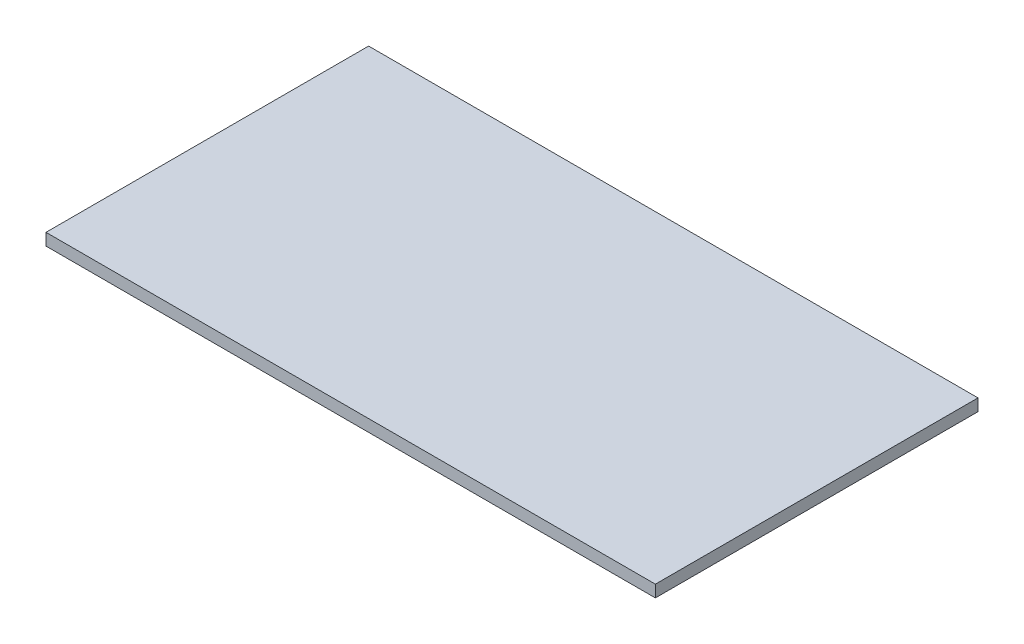
ISO-10303-21;
HEADER;
FILE_DESCRIPTION(('STEP AP214'),'2;1');
FILE_NAME('part.step','',(''),(''),'','','');
FILE_SCHEMA(('AUTOMOTIVE_DESIGN { 1 0 10303 214 1 1 1 1 }'));
ENDSEC;
DATA;
#1=APPLICATION_CONTEXT('core data for automotive mechanical design processes');
#2=APPLICATION_PROTOCOL_DEFINITION('international standard','automotive_design',2000,#1);
#3=PRODUCT_CONTEXT('',#1,'mechanical');
#4=PRODUCT('Part','Part','',(#3));
#5=PRODUCT_RELATED_PRODUCT_CATEGORY('part','',(#4));
#6=PRODUCT_DEFINITION_FORMATION('','',#4);
#7=PRODUCT_DEFINITION_CONTEXT('part definition',#1,'design');
#8=PRODUCT_DEFINITION('design','',#6,#7);
#9=PRODUCT_DEFINITION_SHAPE('','',#8);
#10=(LENGTH_UNIT() NAMED_UNIT(*) SI_UNIT(.MILLI.,.METRE.));
#11=(NAMED_UNIT(*) PLANE_ANGLE_UNIT() SI_UNIT($,.RADIAN.));
#12=(NAMED_UNIT(*) SI_UNIT($,.STERADIAN.) SOLID_ANGLE_UNIT());
#13=UNCERTAINTY_MEASURE_WITH_UNIT(LENGTH_MEASURE(1.E-05),#10,'distance_accuracy_value','');
#14=(GEOMETRIC_REPRESENTATION_CONTEXT(3) GLOBAL_UNCERTAINTY_ASSIGNED_CONTEXT((#13)) GLOBAL_UNIT_ASSIGNED_CONTEXT((#10,
#11,#12)) REPRESENTATION_CONTEXT('',''));
#15=CARTESIAN_POINT('',(0.,0.,0.));
#16=DIRECTION('',(0.,0.,1.));
#17=DIRECTION('',(1.,0.,0.));
#18=AXIS2_PLACEMENT_3D('',#15,#16,#17);
#19=CARTESIAN_POINT('',(255.,10.,135.));
#20=DIRECTION('',(-1.,0.,0.));
#21=DIRECTION('',(0.,0.,1.));
#22=AXIS2_PLACEMENT_3D('',#19,#20,#21);
#23=PLANE('',#22);
#24=DIRECTION('',(0.,0.,-1.));
#25=VECTOR('',#24,1.);
#26=CARTESIAN_POINT('',(255.,0.,135.));
#27=LINE('',#26,#25);
#28=CARTESIAN_POINT('',(255.,0.,135.));
#29=VERTEX_POINT('',#28);
#30=CARTESIAN_POINT('',(255.,0.,-135.));
#31=VERTEX_POINT('',#30);
#32=EDGE_CURVE('E98',#29,#31,#27,.T.);
#33=ORIENTED_EDGE('',*,*,#32,.T.);
#34=DIRECTION('',(0.,-1.,0.));
#35=VECTOR('',#34,1.);
#36=CARTESIAN_POINT('',(255.,10.,-135.));
#37=LINE('',#36,#35);
#38=CARTESIAN_POINT('',(255.,10.,-135.));
#39=VERTEX_POINT('',#38);
#40=EDGE_CURVE('E11',#39,#31,#37,.T.);
#41=ORIENTED_EDGE('',*,*,#40,.F.);
#42=DIRECTION('',(0.,0.,-1.));
#43=VECTOR('',#42,1.);
#44=CARTESIAN_POINT('',(255.,10.,135.));
#45=LINE('',#44,#43);
#46=CARTESIAN_POINT('',(255.,10.,135.));
#47=VERTEX_POINT('',#46);
#48=EDGE_CURVE('E86',#47,#39,#45,.T.);
#49=ORIENTED_EDGE('',*,*,#48,.F.);
#50=DIRECTION('',(0.,-1.,0.));
#51=VECTOR('',#50,1.);
#52=CARTESIAN_POINT('',(255.,10.,135.));
#53=LINE('',#52,#51);
#54=EDGE_CURVE('E94',#47,#29,#53,.T.);
#55=ORIENTED_EDGE('',*,*,#54,.T.);
#56=EDGE_LOOP('',(#33,#41,#49,#55));
#57=FACE_BOUND('',#56,.T.);
#58=ADVANCED_FACE('F35',(#57),#23,.F.);
#59=CARTESIAN_POINT('',(-255.,10.,-135.));
#60=DIRECTION('',(0.,0.,1.));
#61=DIRECTION('',(1.,0.,0.));
#62=AXIS2_PLACEMENT_3D('',#59,#60,#61);
#63=PLANE('',#62);
#64=DIRECTION('',(-1.,0.,0.));
#65=VECTOR('',#64,1.);
#66=CARTESIAN_POINT('',(-255.,0.,-135.));
#67=LINE('',#66,#65);
#68=CARTESIAN_POINT('',(-255.,0.,-135.));
#69=VERTEX_POINT('',#68);
#70=EDGE_CURVE('E90',#31,#69,#67,.T.);
#71=ORIENTED_EDGE('',*,*,#70,.T.);
#72=DIRECTION('',(0.,-1.,0.));
#73=VECTOR('',#72,1.);
#74=CARTESIAN_POINT('',(-255.,10.,-135.));
#75=LINE('',#74,#73);
#76=CARTESIAN_POINT('',(-255.,10.,-135.));
#77=VERTEX_POINT('',#76);
#78=EDGE_CURVE('E43',#77,#69,#75,.T.);
#79=ORIENTED_EDGE('',*,*,#78,.F.);
#80=DIRECTION('',(-1.,0.,0.));
#81=VECTOR('',#80,1.);
#82=CARTESIAN_POINT('',(-255.,10.,-135.));
#83=LINE('',#82,#81);
#84=EDGE_CURVE('E81',#39,#77,#83,.T.);
#85=ORIENTED_EDGE('',*,*,#84,.F.);
#86=ORIENTED_EDGE('',*,*,#40,.T.);
#87=EDGE_LOOP('',(#71,#79,#85,#86));
#88=FACE_BOUND('',#87,.T.);
#89=ADVANCED_FACE('F89',(#88),#63,.F.);
#90=CARTESIAN_POINT('',(-255.,10.,135.));
#91=DIRECTION('',(1.,0.,0.));
#92=DIRECTION('',(0.,0.,-1.));
#93=AXIS2_PLACEMENT_3D('',#90,#91,#92);
#94=PLANE('',#93);
#95=DIRECTION('',(0.,0.,1.));
#96=VECTOR('',#95,1.);
#97=CARTESIAN_POINT('',(-255.,0.,135.));
#98=LINE('',#97,#96);
#99=CARTESIAN_POINT('',(-255.,0.,135.));
#100=VERTEX_POINT('',#99);
#101=EDGE_CURVE('E68',#69,#100,#98,.T.);
#102=ORIENTED_EDGE('',*,*,#101,.T.);
#103=DIRECTION('',(0.,-1.,0.));
#104=VECTOR('',#103,1.);
#105=CARTESIAN_POINT('',(-255.,10.,135.));
#106=LINE('',#105,#104);
#107=CARTESIAN_POINT('',(-255.,10.,135.));
#108=VERTEX_POINT('',#107);
#109=EDGE_CURVE('E91',#108,#100,#106,.T.);
#110=ORIENTED_EDGE('',*,*,#109,.F.);
#111=DIRECTION('',(0.,0.,1.));
#112=VECTOR('',#111,1.);
#113=CARTESIAN_POINT('',(-255.,10.,135.));
#114=LINE('',#113,#112);
#115=EDGE_CURVE('E84',#77,#108,#114,.T.);
#116=ORIENTED_EDGE('',*,*,#115,.F.);
#117=ORIENTED_EDGE('',*,*,#78,.T.);
#118=EDGE_LOOP('',(#102,#110,#116,#117));
#119=FACE_BOUND('',#118,.T.);
#120=ADVANCED_FACE('F92',(#119),#94,.F.);
#121=CARTESIAN_POINT('',(-255.,10.,135.));
#122=DIRECTION('',(0.,0.,-1.));
#123=DIRECTION('',(-1.,0.,0.));
#124=AXIS2_PLACEMENT_3D('',#121,#122,#123);
#125=PLANE('',#124);
#126=DIRECTION('',(1.,0.,0.));
#127=VECTOR('',#126,1.);
#128=CARTESIAN_POINT('',(-255.,0.,135.));
#129=LINE('',#128,#127);
#130=EDGE_CURVE('E74',#100,#29,#129,.T.);
#131=ORIENTED_EDGE('',*,*,#130,.T.);
#132=ORIENTED_EDGE('',*,*,#54,.F.);
#133=DIRECTION('',(1.,0.,0.));
#134=VECTOR('',#133,1.);
#135=CARTESIAN_POINT('',(-255.,10.,135.));
#136=LINE('',#135,#134);
#137=EDGE_CURVE('E51',#108,#47,#136,.T.);
#138=ORIENTED_EDGE('',*,*,#137,.F.);
#139=ORIENTED_EDGE('',*,*,#109,.T.);
#140=EDGE_LOOP('',(#131,#132,#138,#139));
#141=FACE_BOUND('',#140,.T.);
#142=ADVANCED_FACE('F105',(#141),#125,.F.);
#143=CARTESIAN_POINT('',(0.,10.,0.));
#144=DIRECTION('',(0.,-1.,0.));
#145=DIRECTION('',(0.,0.,-1.));
#146=AXIS2_PLACEMENT_3D('',#143,#144,#145);
#147=PLANE('',#146);
#148=ORIENTED_EDGE('',*,*,#48,.T.);
#149=ORIENTED_EDGE('',*,*,#84,.T.);
#150=ORIENTED_EDGE('',*,*,#115,.T.);
#151=ORIENTED_EDGE('',*,*,#137,.T.);
#152=EDGE_LOOP('',(#148,#149,#150,#151));
#153=FACE_BOUND('',#152,.T.);
#154=ADVANCED_FACE('F82',(#153),#147,.F.);
#155=CARTESIAN_POINT('',(0.,0.,0.));
#156=DIRECTION('',(0.,-1.,0.));
#157=DIRECTION('',(0.,0.,-1.));
#158=AXIS2_PLACEMENT_3D('',#155,#156,#157);
#159=PLANE('',#158);
#160=ORIENTED_EDGE('',*,*,#32,.F.);
#161=ORIENTED_EDGE('',*,*,#130,.F.);
#162=ORIENTED_EDGE('',*,*,#101,.F.);
#163=ORIENTED_EDGE('',*,*,#70,.F.);
#164=EDGE_LOOP('',(#160,#161,#162,#163));
#165=FACE_BOUND('',#164,.T.);
#166=ADVANCED_FACE('F108',(#165),#159,.T.);
#167=CLOSED_SHELL('',(#58,#89,#120,#142,#154,#166));
#168=MANIFOLD_SOLID_BREP('B2',#167);
#169=ADVANCED_BREP_SHAPE_REPRESENTATION('',(#18,#168),#14);
#170=SHAPE_DEFINITION_REPRESENTATION(#9,#169);
ENDSEC;
END-ISO-10303-21;
